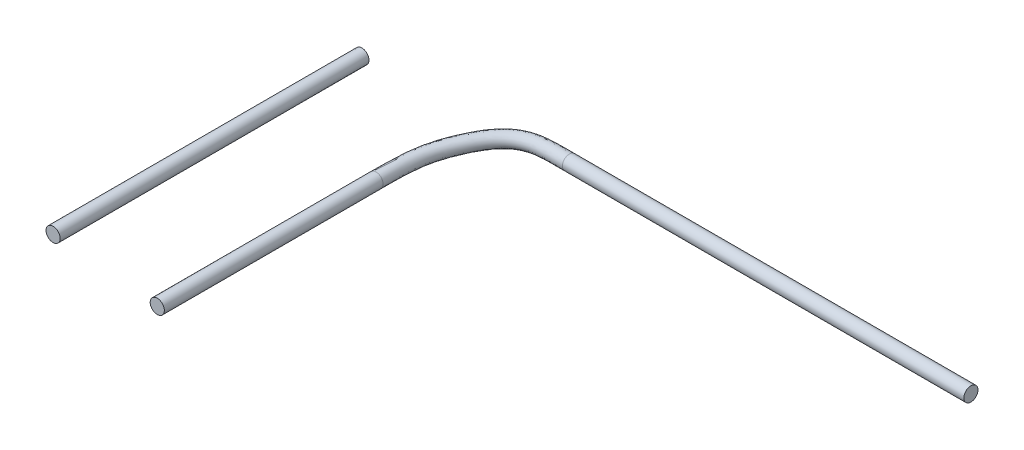
ISO-10303-21;
HEADER;
FILE_DESCRIPTION(('STEP AP214'),'2;1');
FILE_NAME('part.step','',(''),(''),'','','');
FILE_SCHEMA(('AUTOMOTIVE_DESIGN { 1 0 10303 214 1 1 1 1 }'));
ENDSEC;
DATA;
#1=APPLICATION_CONTEXT('core data for automotive mechanical design processes');
#2=APPLICATION_PROTOCOL_DEFINITION('international standard','automotive_design',2000,#1);
#3=PRODUCT_CONTEXT('',#1,'mechanical');
#4=PRODUCT('Part','Part','',(#3));
#5=PRODUCT_RELATED_PRODUCT_CATEGORY('part','',(#4));
#6=PRODUCT_DEFINITION_FORMATION('','',#4);
#7=PRODUCT_DEFINITION_CONTEXT('part definition',#1,'design');
#8=PRODUCT_DEFINITION('design','',#6,#7);
#9=PRODUCT_DEFINITION_SHAPE('','',#8);
#10=(LENGTH_UNIT() NAMED_UNIT(*) SI_UNIT(.MILLI.,.METRE.));
#11=(NAMED_UNIT(*) PLANE_ANGLE_UNIT() SI_UNIT($,.RADIAN.));
#12=(NAMED_UNIT(*) SI_UNIT($,.STERADIAN.) SOLID_ANGLE_UNIT());
#13=UNCERTAINTY_MEASURE_WITH_UNIT(LENGTH_MEASURE(1.E-05),#10,'distance_accuracy_value','');
#14=(GEOMETRIC_REPRESENTATION_CONTEXT(3) GLOBAL_UNCERTAINTY_ASSIGNED_CONTEXT((#13)) GLOBAL_UNIT_ASSIGNED_CONTEXT((#10,
#11,#12)) REPRESENTATION_CONTEXT('',''));
#15=CARTESIAN_POINT('',(0.,0.,0.));
#16=DIRECTION('',(0.,0.,1.));
#17=DIRECTION('',(1.,0.,0.));
#18=AXIS2_PLACEMENT_3D('',#15,#16,#17);
#19=CARTESIAN_POINT('',(70.,0.,-9.29));
#20=DIRECTION('',(1.,0.,0.));
#21=DIRECTION('',(0.,0.,-1.));
#22=AXIS2_PLACEMENT_3D('',#19,#20,#21);
#23=CYLINDRICAL_SURFACE('',#22,5.5);
#24=CARTESIAN_POINT('',(70.,0.,-9.29));
#25=DIRECTION('',(-1.,0.,0.));
#26=DIRECTION('',(0.,0.,1.));
#27=AXIS2_PLACEMENT_3D('',#24,#25,#26);
#28=CIRCLE('',#27,5.5);
#29=CARTESIAN_POINT('',(70.,0.,-3.79));
#30=VERTEX_POINT('',#29);
#31=EDGE_CURVE('E48',#30,#30,#28,.T.);
#32=ORIENTED_EDGE('',*,*,#31,.F.);
#33=EDGE_LOOP('',(#32));
#34=FACE_BOUND('',#33,.T.);
#35=CARTESIAN_POINT('',(382.,0.,-9.29));
#36=DIRECTION('',(1.,0.,0.));
#37=DIRECTION('',(0.,0.,-1.));
#38=AXIS2_PLACEMENT_3D('',#35,#36,#37);
#39=CIRCLE('',#38,5.5);
#40=CARTESIAN_POINT('',(382.,0.,-14.79));
#41=VERTEX_POINT('',#40);
#42=EDGE_CURVE('E44',#41,#41,#39,.F.);
#43=ORIENTED_EDGE('',*,*,#42,.T.);
#44=EDGE_LOOP('',(#43));
#45=FACE_BOUND('',#44,.T.);
#46=ADVANCED_FACE('F41',(#34,#45),#23,.T.);
#47=CARTESIAN_POINT('',(70.,0.,-3.79));
#48=CARTESIAN_POINT('',(66.768864325243,0.,-3.79000000018053));
#49=CARTESIAN_POINT('',(63.9570481975253,0.,-3.79354765094241));
#50=CARTESIAN_POINT('',(58.8341601415756,0.,-3.75597120071562));
#51=CARTESIAN_POINT('',(56.5362354303512,0.,-3.71177023548272));
#52=CARTESIAN_POINT('',(50.2689526000204,0.,-3.40696207083984));
#53=CARTESIAN_POINT('',(46.9156213319749,0.,-2.96294544602353));
#54=CARTESIAN_POINT('',(41.1725472711318,0.,-1.39181044987084));
#55=CARTESIAN_POINT('',(38.7418851754192,0.,-0.279866325147577));
#56=CARTESIAN_POINT('',(34.0794773440239,0.,2.94303041372175));
#57=CARTESIAN_POINT('',(31.827987300764,0.,5.10028604598153));
#58=CARTESIAN_POINT('',(27.4915179768865,0.,10.6659813885908));
#59=CARTESIAN_POINT('',(25.4056036307388,0.,14.0966588539346));
#60=CARTESIAN_POINT('',(22.4816824977374,0.,19.9272021427623));
#61=CARTESIAN_POINT('',(21.5390192154418,0.,21.9802146683153));
#62=CARTESIAN_POINT('',(19.7220214371824,0.,26.2615888743202));
#63=CARTESIAN_POINT('',(18.8545543472879,0.,28.4685572988092));
#64=CARTESIAN_POINT('',(17.218095172866,0.,33.0645353194089));
#65=CARTESIAN_POINT('',(16.4612076126833,0.,35.4142262313289));
#66=CARTESIAN_POINT('',(15.0995919428231,0.,40.5000270527348));
#67=CARTESIAN_POINT('',(14.5033342783833,0.,43.1948845226623));
#68=CARTESIAN_POINT('',(13.5088299947119,0.,49.6516341781616));
#69=CARTESIAN_POINT('',(13.114450450163,0.,53.3893259822742));
#70=CARTESIAN_POINT('',(12.5770200518211,0.,63.2914559465208));
#71=CARTESIAN_POINT('',(12.4349622285275,0.,69.4509849315926));
#72=CARTESIAN_POINT('',(12.4349622284904,0.,77.9565656259676));
#73=CARTESIAN_POINT('',(70.,11.,-3.79));
#74=CARTESIAN_POINT('',(66.768864325243,11.,-3.79000000018053));
#75=CARTESIAN_POINT('',(63.9570481975253,11.,-3.79354765094241));
#76=CARTESIAN_POINT('',(58.8341601415756,11.,-3.75597120071562));
#77=CARTESIAN_POINT('',(56.5362354303512,11.,-3.71177023548272));
#78=CARTESIAN_POINT('',(50.2689526000204,11.,-3.40696207083984));
#79=CARTESIAN_POINT('',(46.9156213319749,11.,-2.96294544602353));
#80=CARTESIAN_POINT('',(41.1725472711318,11.,-1.39181044987084));
#81=CARTESIAN_POINT('',(38.7418851754192,11.,-0.279866325147577));
#82=CARTESIAN_POINT('',(34.0794773440239,11.,2.94303041372175));
#83=CARTESIAN_POINT('',(31.827987300764,11.,5.10028604598153));
#84=CARTESIAN_POINT('',(27.4915179768865,11.,10.6659813885908));
#85=CARTESIAN_POINT('',(25.4056036307388,11.,14.0966588539346));
#86=CARTESIAN_POINT('',(22.4816824977374,11.,19.9272021427623));
#87=CARTESIAN_POINT('',(21.5390192154418,11.,21.9802146683153));
#88=CARTESIAN_POINT('',(19.7220214371824,11.,26.2615888743202));
#89=CARTESIAN_POINT('',(18.8545543472879,11.,28.4685572988092));
#90=CARTESIAN_POINT('',(17.218095172866,11.,33.0645353194089));
#91=CARTESIAN_POINT('',(16.4612076126833,11.,35.4142262313289));
#92=CARTESIAN_POINT('',(15.0995919428231,11.,40.5000270527348));
#93=CARTESIAN_POINT('',(14.5033342783833,11.,43.1948845226623));
#94=CARTESIAN_POINT('',(13.5088299947119,11.,49.6516341781616));
#95=CARTESIAN_POINT('',(13.114450450163,11.,53.3893259822742));
#96=CARTESIAN_POINT('',(12.5770200518211,11.,63.2914559465208));
#97=CARTESIAN_POINT('',(12.4349622285275,11.,69.4509849315926));
#98=CARTESIAN_POINT('',(12.4349622284904,11.,77.9565656259676));
#99=CARTESIAN_POINT('',(70.,11.,-14.79));
#100=CARTESIAN_POINT('',(66.7771952499507,11.,-14.7900000001707));
#101=CARTESIAN_POINT('',(63.9490096334225,11.,-14.7937846023287));
#102=CARTESIAN_POINT('',(58.6808342460597,11.,-14.7551424575329));
#103=CARTESIAN_POINT('',(56.2395618569544,11.,-14.7103433054113));
#104=CARTESIAN_POINT('',(49.259247765555,11.,-14.3708569392));
#105=CARTESIAN_POINT('',(45.0821229921544,11.,-13.8655525043441));
#106=CARTESIAN_POINT('',(37.2008110582003,11.,-11.7094590871713));
#107=CARTESIAN_POINT('',(33.5305212502583,11.,-10.0497608360905));
#108=CARTESIAN_POINT('',(26.7811472629466,11.,-5.38424490573387));
#109=CARTESIAN_POINT('',(23.7311703078814,11.,-2.40524988849409));
#110=CARTESIAN_POINT('',(18.2340698658006,11.,4.6500720341492));
#111=CARTESIAN_POINT('',(15.8113436642132,11.,8.68986007925783));
#112=CARTESIAN_POINT('',(12.5295256827828,11.,15.2340794457741));
#113=CARTESIAN_POINT('',(11.492773906376,11.,17.4952993641617));
#114=CARTESIAN_POINT('',(9.51658498058369,11.,22.1517740685605));
#115=CARTESIAN_POINT('',(8.56873218284257,11.,24.562870508487));
#116=CARTESIAN_POINT('',(6.7785177607508,11.,29.5906684381393));
#117=CARTESIAN_POINT('',(5.92451305604198,11.,32.2366966443218));
#118=CARTESIAN_POINT('',(4.38474811191397,11.,37.9879067241083));
#119=CARTESIAN_POINT('',(3.69344669508546,11.,41.1184181816926));
#120=CARTESIAN_POINT('',(2.57512669122216,11.,48.3790326864344));
#121=CARTESIAN_POINT('',(2.14599336138466,11.,52.5098606444906));
#122=CARTESIAN_POINT('',(1.57780832370404,11.,62.9786433170487));
#123=CARTESIAN_POINT('',(1.43496222849781,11.,69.3290399655009));
#124=CARTESIAN_POINT('',(1.43496222849038,11.,77.9565656259676));
#125=CARTESIAN_POINT('',(70.,0.,-14.79));
#126=CARTESIAN_POINT('',(66.7771952499507,0.,-14.7900000001707));
#127=CARTESIAN_POINT('',(63.9490096334225,0.,-14.7937846023287));
#128=CARTESIAN_POINT('',(58.6808342460597,0.,-14.7551424575329));
#129=CARTESIAN_POINT('',(56.2395618569544,0.,-14.7103433054093));
#130=CARTESIAN_POINT('',(49.259247765555,0.,-14.3708569392039));
#131=CARTESIAN_POINT('',(45.0821229921544,0.,-13.8655525043441));
#132=CARTESIAN_POINT('',(37.2008110582003,0.,-11.7094590871713));
#133=CARTESIAN_POINT('',(33.5305212502643,0.,-10.0497608360845));
#134=CARTESIAN_POINT('',(26.7811472629405,0.,-5.38424490573989));
#135=CARTESIAN_POINT('',(23.7311703078884,0.,-2.40524988848021));
#136=CARTESIAN_POINT('',(18.2340698657937,0.,4.65007203413532));
#137=CARTESIAN_POINT('',(15.8113436642132,0.,8.68986007925783));
#138=CARTESIAN_POINT('',(12.5295256827828,0.,15.2340794457741));
#139=CARTESIAN_POINT('',(11.492773906376,0.,17.4952993641617));
#140=CARTESIAN_POINT('',(9.51658498058369,0.,22.1517740685605));
#141=CARTESIAN_POINT('',(8.56873218284257,0.,24.562870508487));
#142=CARTESIAN_POINT('',(6.7785177607508,0.,29.5906684381393));
#143=CARTESIAN_POINT('',(5.92451305604198,0.,32.2366966443218));
#144=CARTESIAN_POINT('',(4.38474811191397,0.,37.9879067241083));
#145=CARTESIAN_POINT('',(3.69344669508546,0.,41.1184181816926));
#146=CARTESIAN_POINT('',(2.57512669122216,0.,48.3790326864344));
#147=CARTESIAN_POINT('',(2.14599336138466,0.,52.5098606444906));
#148=CARTESIAN_POINT('',(1.57780832370404,0.,62.9786433170487));
#149=CARTESIAN_POINT('',(1.43496222849781,0.,69.3290399655009));
#150=CARTESIAN_POINT('',(1.43496222849038,0.,77.9565656259676));
#151=CARTESIAN_POINT('',(70.,-11.,-14.79));
#152=CARTESIAN_POINT('',(66.7771952499507,-11.,-14.7900000001707));
#153=CARTESIAN_POINT('',(63.9490096334225,-11.,-14.7937846023287));
#154=CARTESIAN_POINT('',(58.6808342460597,-11.,-14.7551424575329));
#155=CARTESIAN_POINT('',(56.2395618569544,-11.,-14.7103433054074));
#156=CARTESIAN_POINT('',(49.259247765555,-11.,-14.3708569392077));
#157=CARTESIAN_POINT('',(45.0821229921544,-11.,-13.8655525043441));
#158=CARTESIAN_POINT('',(37.2008110582003,-11.,-11.7094590871713));
#159=CARTESIAN_POINT('',(33.5305212502703,-11.,-10.0497608360785));
#160=CARTESIAN_POINT('',(26.7811472629345,-11.,-5.3842449057459));
#161=CARTESIAN_POINT('',(23.7311703078953,-11.,-2.40524988846633));
#162=CARTESIAN_POINT('',(18.2340698657867,-11.,4.65007203412144));
#163=CARTESIAN_POINT('',(15.8113436642132,-11.,8.68986007925782));
#164=CARTESIAN_POINT('',(12.5295256827828,-11.,15.2340794457741));
#165=CARTESIAN_POINT('',(11.492773906376,-11.,17.4952993641617));
#166=CARTESIAN_POINT('',(9.51658498058369,-11.,22.1517740685605));
#167=CARTESIAN_POINT('',(8.56873218284257,-11.,24.562870508487));
#168=CARTESIAN_POINT('',(6.77851776075079,-11.,29.5906684381393));
#169=CARTESIAN_POINT('',(5.92451305604198,-11.,32.2366966443218));
#170=CARTESIAN_POINT('',(4.38474811191397,-11.,37.9879067241083));
#171=CARTESIAN_POINT('',(3.69344669508546,-11.,41.1184181816926));
#172=CARTESIAN_POINT('',(2.57512669122216,-11.,48.3790326864344));
#173=CARTESIAN_POINT('',(2.14599336138466,-11.,52.5098606444906));
#174=CARTESIAN_POINT('',(1.57780832370404,-11.,62.9786433170487));
#175=CARTESIAN_POINT('',(1.43496222849781,-11.,69.3290399655009));
#176=CARTESIAN_POINT('',(1.43496222849038,-11.,77.9565656259676));
#177=CARTESIAN_POINT('',(70.,-11.,-3.79));
#178=CARTESIAN_POINT('',(66.768864325243,-11.,-3.79000000018053));
#179=CARTESIAN_POINT('',(63.9570481975253,-11.,-3.79354765094241));
#180=CARTESIAN_POINT('',(58.8341601415756,-11.,-3.75597120071562));
#181=CARTESIAN_POINT('',(56.5362354303512,-11.,-3.71177023548272));
#182=CARTESIAN_POINT('',(50.2689526000204,-11.,-3.40696207083984));
#183=CARTESIAN_POINT('',(46.9156213319749,-11.,-2.96294544602353));
#184=CARTESIAN_POINT('',(41.1725472711318,-11.,-1.39181044987084));
#185=CARTESIAN_POINT('',(38.7418851754192,-11.,-0.279866325147577));
#186=CARTESIAN_POINT('',(34.0794773440239,-11.,2.94303041372175));
#187=CARTESIAN_POINT('',(31.827987300764,-11.,5.10028604598153));
#188=CARTESIAN_POINT('',(27.4915179768865,-11.,10.6659813885908));
#189=CARTESIAN_POINT('',(25.4056036307388,-11.,14.0966588539346));
#190=CARTESIAN_POINT('',(22.4816824977374,-11.,19.9272021427623));
#191=CARTESIAN_POINT('',(21.5390192154418,-11.,21.9802146683153));
#192=CARTESIAN_POINT('',(19.7220214371824,-11.,26.2615888743202));
#193=CARTESIAN_POINT('',(18.8545543472879,-11.,28.4685572988092));
#194=CARTESIAN_POINT('',(17.218095172866,-11.,33.0645353194089));
#195=CARTESIAN_POINT('',(16.4612076126833,-11.,35.4142262313289));
#196=CARTESIAN_POINT('',(15.0995919428231,-11.,40.5000270527348));
#197=CARTESIAN_POINT('',(14.5033342783833,-11.,43.1948845226623));
#198=CARTESIAN_POINT('',(13.5088299947119,-11.,49.6516341781616));
#199=CARTESIAN_POINT('',(13.114450450163,-11.,53.3893259822742));
#200=CARTESIAN_POINT('',(12.5770200518211,-11.,63.2914559465208));
#201=CARTESIAN_POINT('',(12.4349622285275,-11.,69.4509849315926));
#202=CARTESIAN_POINT('',(12.4349622284904,-11.,77.9565656259676));
#203=CARTESIAN_POINT('',(70.,0.,-3.79));
#204=CARTESIAN_POINT('',(66.768864325243,0.,-3.79000000018053));
#205=CARTESIAN_POINT('',(63.9570481975253,0.,-3.79354765094241));
#206=CARTESIAN_POINT('',(58.8341601415756,0.,-3.75597120071562));
#207=CARTESIAN_POINT('',(56.5362354303512,0.,-3.71177023548272));
#208=CARTESIAN_POINT('',(50.2689526000204,0.,-3.40696207083984));
#209=CARTESIAN_POINT('',(46.9156213319749,0.,-2.96294544602353));
#210=CARTESIAN_POINT('',(41.1725472711318,0.,-1.39181044987084));
#211=CARTESIAN_POINT('',(38.7418851754192,0.,-0.279866325147577));
#212=CARTESIAN_POINT('',(34.0794773440239,0.,2.94303041372175));
#213=CARTESIAN_POINT('',(31.827987300764,0.,5.10028604598153));
#214=CARTESIAN_POINT('',(27.4915179768865,0.,10.6659813885908));
#215=CARTESIAN_POINT('',(25.4056036307388,0.,14.0966588539346));
#216=CARTESIAN_POINT('',(22.4816824977374,0.,19.9272021427623));
#217=CARTESIAN_POINT('',(21.5390192154418,0.,21.9802146683153));
#218=CARTESIAN_POINT('',(19.7220214371824,0.,26.2615888743202));
#219=CARTESIAN_POINT('',(18.8545543472879,0.,28.4685572988092));
#220=CARTESIAN_POINT('',(17.218095172866,0.,33.0645353194089));
#221=CARTESIAN_POINT('',(16.4612076126833,0.,35.4142262313289));
#222=CARTESIAN_POINT('',(15.0995919428231,0.,40.5000270527348));
#223=CARTESIAN_POINT('',(14.5033342783833,0.,43.1948845226623));
#224=CARTESIAN_POINT('',(13.5088299947119,0.,49.6516341781616));
#225=CARTESIAN_POINT('',(13.114450450163,0.,53.3893259822742));
#226=CARTESIAN_POINT('',(12.5770200518211,0.,63.2914559465208));
#227=CARTESIAN_POINT('',(12.4349622285275,0.,69.4509849315926));
#228=CARTESIAN_POINT('',(12.4349622284904,0.,77.9565656259676));
#229=(BOUNDED_SURFACE() B_SPLINE_SURFACE(3,3,((#47,#48,#49,#50,#51,#52,#53,#54,#55,#56,#57,#58,
#59,#60,#61,#62,#63,#64,#65,#66,#67,#68,#69,#70,#71,#72),(#73,#74,#75,#76,#77,#78,#79,#80,#81,
#82,#83,#84,#85,#86,#87,#88,#89,#90,#91,#92,#93,#94,#95,#96,#97,#98),(#99,#100,#101,#102,#103,
#104,#105,#106,#107,#108,#109,#110,#111,#112,#113,#114,#115,#116,#117,#118,#119,#120,#121,#122,
#123,#124),(#125,#126,#127,#128,#129,#130,#131,#132,#133,#134,#135,#136,#137,#138,#139,#140,
#141,#142,#143,#144,#145,#146,#147,#148,#149,#150),(#151,#152,#153,#154,#155,#156,#157,#158,
#159,#160,#161,#162,#163,#164,#165,#166,#167,#168,#169,#170,#171,#172,#173,#174,#175,#176),
(#177,#178,#179,#180,#181,#182,#183,#184,#185,#186,#187,#188,#189,#190,#191,#192,#193,#194,#195,
#196,#197,#198,#199,#200,#201,#202),(#203,#204,#205,#206,#207,#208,#209,#210,#211,#212,#213,
#214,#215,#216,#217,#218,#219,#220,#221,#222,#223,#224,#225,#226,#227,#228)),.UNSPECIFIED.,.T.,
.F.,.F.) B_SPLINE_SURFACE_WITH_KNOTS((4,3,4),(4,2,2,2,2,2,2,2,2,2,2,2,4),(0.,0.5,1.),(0.,0.0625,
0.125,0.25,0.375,0.5,0.625,0.6875,0.75,0.8125,0.875,0.9375,1.),
.UNSPECIFIED.) GEOMETRIC_REPRESENTATION_ITEM() RATIONAL_B_SPLINE_SURFACE(((1.,1.,1.,1.,1.,1.,1.,
1.,1.,1.,1.,1.,1.,1.,1.,1.,1.,1.,1.,1.,1.,1.,1.,1.,1.,1.),(0.333333333333333,0.333333333333333,
0.333333333333333,0.333333333333333,0.333333333333333,0.333333333333333,0.333333333333333,
0.333333333333333,0.333333333333333,0.333333333333333,0.333333333333333,0.333333333333333,
0.333333333333333,0.333333333333333,0.333333333333333,0.333333333333333,0.333333333333333,
0.333333333333333,0.333333333333333,0.333333333333333,0.333333333333333,0.333333333333333,
0.333333333333333,0.333333333333333,0.333333333333333,0.333333333333333),(0.333333333333333,
0.333333333333333,0.333333333333333,0.333333333333333,0.333333333333333,0.333333333333333,
0.333333333333333,0.333333333333333,0.333333333333333,0.333333333333333,0.333333333333333,
0.333333333333333,0.333333333333333,0.333333333333333,0.333333333333333,0.333333333333333,
0.333333333333333,0.333333333333333,0.333333333333333,0.333333333333333,0.333333333333333,
0.333333333333333,0.333333333333333,0.333333333333333,0.333333333333333,0.333333333333333),(1.,
1.,1.,1.,1.,1.,1.,1.,1.,1.,1.,1.,1.,1.,1.,1.,1.,1.,1.,1.,1.,1.,1.,1.,1.,1.),(0.333333333333333,
0.333333333333333,0.333333333333333,0.333333333333333,0.333333333333333,0.333333333333333,
0.333333333333333,0.333333333333333,0.333333333333333,0.333333333333333,0.333333333333333,
0.333333333333333,0.333333333333333,0.333333333333333,0.333333333333333,0.333333333333333,
0.333333333333333,0.333333333333333,0.333333333333333,0.333333333333333,0.333333333333333,
0.333333333333333,0.333333333333333,0.333333333333333,0.333333333333333,0.333333333333333),
(0.333333333333333,0.333333333333333,0.333333333333333,0.333333333333333,0.333333333333333,
0.333333333333333,0.333333333333333,0.333333333333333,0.333333333333333,0.333333333333333,
0.333333333333333,0.333333333333333,0.333333333333333,0.333333333333333,0.333333333333333,
0.333333333333333,0.333333333333333,0.333333333333333,0.333333333333333,0.333333333333333,
0.333333333333333,0.333333333333333,0.333333333333333,0.333333333333333,0.333333333333333,
0.333333333333333),(1.,1.,1.,1.,1.,1.,1.,1.,1.,1.,1.,1.,1.,1.,1.,1.,1.,1.,1.,1.,1.,1.,1.,1.,1.,1.))) REPRESENTATION_ITEM('') SURFACE());
#230=CARTESIAN_POINT('',(6.93496222849038,0.,77.9565656259676));
#231=DIRECTION('',(0.,0.,1.));
#232=DIRECTION('',(1.,0.,0.));
#233=AXIS2_PLACEMENT_3D('',#230,#231,#232);
#234=CIRCLE('',#233,5.5);
#235=CARTESIAN_POINT('',(12.4349622284904,0.,77.9565656259676));
#236=VERTEX_POINT('',#235);
#237=EDGE_CURVE('E11',#236,#236,#234,.T.);
#238=ORIENTED_EDGE('',*,*,#237,.F.);
#239=EDGE_LOOP('',(#238));
#240=FACE_BOUND('',#239,.T.);
#241=ORIENTED_EDGE('',*,*,#31,.T.);
#242=EDGE_LOOP('',(#241));
#243=FACE_BOUND('',#242,.T.);
#244=ADVANCED_FACE('F72',(#240,#243),#229,.T.);
#245=CARTESIAN_POINT('',(6.9349622284904,0.,247.956565625968));
#246=DIRECTION('',(0.,0.,1.));
#247=DIRECTION('',(1.,0.,0.));
#248=AXIS2_PLACEMENT_3D('',#245,#246,#247);
#249=PLANE('',#248);
#250=CARTESIAN_POINT('',(6.9349622284904,0.,247.956565625968));
#251=DIRECTION('',(0.,0.,1.));
#252=DIRECTION('',(1.,0.,0.));
#253=AXIS2_PLACEMENT_3D('',#250,#251,#252);
#254=CIRCLE('',#253,5.5);
#255=CARTESIAN_POINT('',(12.4349622284904,0.,247.956565625968));
#256=VERTEX_POINT('',#255);
#257=EDGE_CURVE('E52',#256,#256,#254,.T.);
#258=ORIENTED_EDGE('',*,*,#257,.T.);
#259=EDGE_LOOP('',(#258));
#260=FACE_BOUND('',#259,.T.);
#261=ADVANCED_FACE('F66',(#260),#249,.T.);
#262=CARTESIAN_POINT('',(6.93496222849038,0.,77.9565656259676));
#263=DIRECTION('',(0.,0.,1.));
#264=DIRECTION('',(1.,0.,0.));
#265=AXIS2_PLACEMENT_3D('',#262,#263,#264);
#266=CYLINDRICAL_SURFACE('',#265,5.5);
#267=ORIENTED_EDGE('',*,*,#257,.F.);
#268=EDGE_LOOP('',(#267));
#269=FACE_BOUND('',#268,.T.);
#270=ORIENTED_EDGE('',*,*,#237,.T.);
#271=EDGE_LOOP('',(#270));
#272=FACE_BOUND('',#271,.T.);
#273=ADVANCED_FACE('F64',(#269,#272),#266,.T.);
#274=CARTESIAN_POINT('',(382.,0.,-9.29));
#275=DIRECTION('',(1.,0.,0.));
#276=DIRECTION('',(0.,0.,-1.));
#277=AXIS2_PLACEMENT_3D('',#274,#275,#276);
#278=PLANE('',#277);
#279=ORIENTED_EDGE('',*,*,#42,.F.);
#280=EDGE_LOOP('',(#279));
#281=FACE_BOUND('',#280,.T.);
#282=ADVANCED_FACE('F62',(#281),#278,.T.);
#283=CLOSED_SHELL('',(#46,#244,#261,#273,#282));
#284=MANIFOLD_SOLID_BREP('B2',#283);
#285=CARTESIAN_POINT('',(-82.,0.,240.));
#286=DIRECTION('',(0.,0.,-1.));
#287=DIRECTION('',(-1.,0.,0.));
#288=AXIS2_PLACEMENT_3D('',#285,#286,#287);
#289=CYLINDRICAL_SURFACE('',#288,5.5);
#290=CARTESIAN_POINT('',(-82.,0.,240.));
#291=DIRECTION('',(0.,0.,1.));
#292=DIRECTION('',(1.,0.,0.));
#293=AXIS2_PLACEMENT_3D('',#290,#291,#292);
#294=CIRCLE('',#293,5.5);
#295=CARTESIAN_POINT('',(-76.5,0.,240.));
#296=VERTEX_POINT('',#295);
#297=EDGE_CURVE('E40',#296,#296,#294,.T.);
#298=ORIENTED_EDGE('',*,*,#297,.F.);
#299=EDGE_LOOP('',(#298));
#300=FACE_BOUND('',#299,.T.);
#301=CARTESIAN_POINT('',(-82.,0.,0.));
#302=DIRECTION('',(0.,0.,1.));
#303=DIRECTION('',(1.,0.,0.));
#304=AXIS2_PLACEMENT_3D('',#301,#302,#303);
#305=CIRCLE('',#304,5.5);
#306=CARTESIAN_POINT('',(-76.5,0.,0.));
#307=VERTEX_POINT('',#306);
#308=EDGE_CURVE('E121',#307,#307,#305,.T.);
#309=ORIENTED_EDGE('',*,*,#308,.T.);
#310=EDGE_LOOP('',(#309));
#311=FACE_BOUND('',#310,.T.);
#312=ADVANCED_FACE('F118',(#300,#311),#289,.T.);
#313=CARTESIAN_POINT('',(-82.,0.,240.));
#314=DIRECTION('',(0.,0.,1.));
#315=DIRECTION('',(1.,0.,0.));
#316=AXIS2_PLACEMENT_3D('',#313,#314,#315);
#317=PLANE('',#316);
#318=ORIENTED_EDGE('',*,*,#297,.T.);
#319=EDGE_LOOP('',(#318));
#320=FACE_BOUND('',#319,.T.);
#321=ADVANCED_FACE('F133',(#320),#317,.T.);
#322=CARTESIAN_POINT('',(-82.,0.,0.));
#323=DIRECTION('',(0.,0.,1.));
#324=DIRECTION('',(1.,0.,0.));
#325=AXIS2_PLACEMENT_3D('',#322,#323,#324);
#326=PLANE('',#325);
#327=ORIENTED_EDGE('',*,*,#308,.F.);
#328=EDGE_LOOP('',(#327));
#329=FACE_BOUND('',#328,.T.);
#330=ADVANCED_FACE('F131',(#329),#326,.F.);
#331=CLOSED_SHELL('',(#312,#321,#330));
#332=MANIFOLD_SOLID_BREP('B6_NOT_SHOWN',#331);
#333=ADVANCED_BREP_SHAPE_REPRESENTATION('',(#18,#284,#332),#14);
#334=SHAPE_DEFINITION_REPRESENTATION(#9,#333);
ENDSEC;
END-ISO-10303-21;
